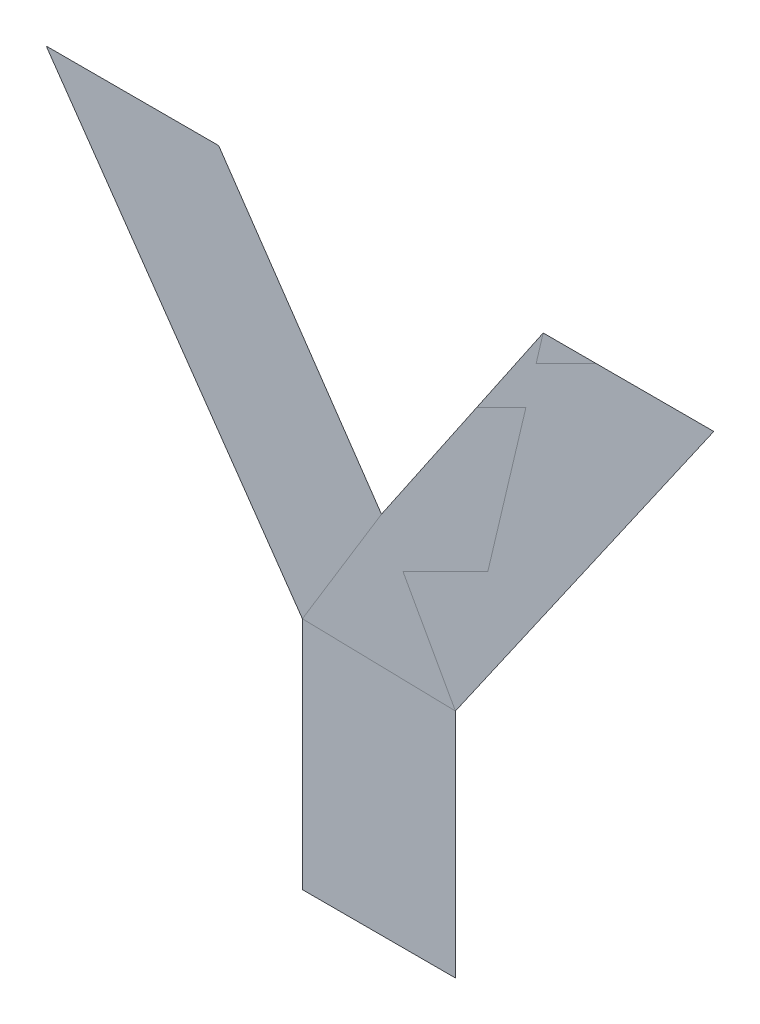
ISO-10303-21;
HEADER;
FILE_DESCRIPTION(('STEP AP214'),'2;1');
FILE_NAME('part.step','',(''),(''),'','','');
FILE_SCHEMA(('AUTOMOTIVE_DESIGN { 1 0 10303 214 1 1 1 1 }'));
ENDSEC;
DATA;
#1=APPLICATION_CONTEXT('core data for automotive mechanical design processes');
#2=APPLICATION_PROTOCOL_DEFINITION('international standard','automotive_design',2000,#1);
#3=PRODUCT_CONTEXT('',#1,'mechanical');
#4=PRODUCT('Part','Part','',(#3));
#5=PRODUCT_RELATED_PRODUCT_CATEGORY('part','',(#4));
#6=PRODUCT_DEFINITION_FORMATION('','',#4);
#7=PRODUCT_DEFINITION_CONTEXT('part definition',#1,'design');
#8=PRODUCT_DEFINITION('design','',#6,#7);
#9=PRODUCT_DEFINITION_SHAPE('','',#8);
#10=(LENGTH_UNIT() NAMED_UNIT(*) SI_UNIT(.MILLI.,.METRE.));
#11=(NAMED_UNIT(*) PLANE_ANGLE_UNIT() SI_UNIT($,.RADIAN.));
#12=(NAMED_UNIT(*) SI_UNIT($,.STERADIAN.) SOLID_ANGLE_UNIT());
#13=UNCERTAINTY_MEASURE_WITH_UNIT(LENGTH_MEASURE(1.E-05),#10,'distance_accuracy_value','');
#14=(GEOMETRIC_REPRESENTATION_CONTEXT(3) GLOBAL_UNCERTAINTY_ASSIGNED_CONTEXT((#13)) GLOBAL_UNIT_ASSIGNED_CONTEXT((#10,
#11,#12)) REPRESENTATION_CONTEXT('',''));
#15=CARTESIAN_POINT('',(0.,0.,0.));
#16=DIRECTION('',(0.,0.,1.));
#17=DIRECTION('',(1.,0.,0.));
#18=AXIS2_PLACEMENT_3D('',#15,#16,#17);
#19=CARTESIAN_POINT('',(0.01323377255932,0.899692190159,0.00015));
#20=DIRECTION('',(0.,0.,1.));
#21=DIRECTION('',(1.,0.,0.));
#22=AXIS2_PLACEMENT_3D('',#19,#20,#21);
#23=PLANE('',#22);
#24=CARTESIAN_POINT('',(0.01329810758435,0.915587292989,0.00015));
#25=DIRECTION('',(-0.564857791545719,0.825188266597443,0.));
#26=VECTOR('',#25,1.);
#27=LINE('',#24,#26);
#28=CARTESIAN_POINT('',(0.01329810758435,0.915587292989,7.5E-05));
#29=VERTEX_POINT('',#28);
#30=CARTESIAN_POINT('',(0.006200809951,0.92595557828,7.5E-05));
#31=VERTEX_POINT('',#30);
#32=EDGE_CURVE('E149',#29,#31,#27,.T.);
#33=ORIENTED_EDGE('',*,*,#32,.T.);
#34=CARTESIAN_POINT('',(0.006200809951,0.92595557828,0.00015));
#35=DIRECTION('',(-1.,0.,0.));
#36=VECTOR('',#35,1.);
#37=LINE('',#34,#36);
#38=CARTESIAN_POINT('',(-0.001316364499,0.92595557828,7.5E-05));
#39=VERTEX_POINT('',#38);
#40=EDGE_CURVE('E28',#31,#39,#37,.T.);
#41=ORIENTED_EDGE('',*,*,#40,.T.);
#42=CARTESIAN_POINT('',(-0.001316364499,0.92595557828,0.00015));
#43=DIRECTION('',(0.571460408227035,-0.820629637430303,0.));
#44=VECTOR('',#43,1.);
#45=LINE('',#42,#44);
#46=CARTESIAN_POINT('',(0.009851043951,0.909918935644,7.5E-05));
#47=VERTEX_POINT('',#46);
#48=EDGE_CURVE('E11',#39,#47,#45,.T.);
#49=ORIENTED_EDGE('',*,*,#48,.T.);
#50=CARTESIAN_POINT('',(0.009851043951,0.909918935644,0.00015));
#51=DIRECTION('',(0.,-1.,0.));
#52=VECTOR('',#51,1.);
#53=LINE('',#50,#52);
#54=CARTESIAN_POINT('',(0.009851043951,0.899692190159,7.5E-05));
#55=VERTEX_POINT('',#54);
#56=EDGE_CURVE('E59',#47,#55,#53,.T.);
#57=ORIENTED_EDGE('',*,*,#56,.T.);
#58=CARTESIAN_POINT('',(0.009851043951,0.899692190159,0.00015));
#59=DIRECTION('',(1.,0.,0.));
#60=VECTOR('',#59,1.);
#61=LINE('',#58,#60);
#62=CARTESIAN_POINT('',(0.01652168931765,0.899692190159,7.5E-05));
#63=VERTEX_POINT('',#62);
#64=EDGE_CURVE('E56',#55,#63,#61,.T.);
#65=ORIENTED_EDGE('',*,*,#64,.T.);
#66=CARTESIAN_POINT('',(0.01652168931765,0.899692190159,0.00015));
#67=DIRECTION('',(0.,1.,0.));
#68=VECTOR('',#67,1.);
#69=LINE('',#66,#68);
#70=CARTESIAN_POINT('',(0.01652168931765,0.909769946652,7.5E-05));
#71=VERTEX_POINT('',#70);
#72=EDGE_CURVE('E143',#63,#71,#69,.T.);
#73=ORIENTED_EDGE('',*,*,#72,.T.);
#74=CARTESIAN_POINT('',(0.01652168931765,0.909769946652,0.00015));
#75=DIRECTION('',(0.571155066162466,0.82084218361202,0.));
#76=VECTOR('',#75,1.);
#77=LINE('',#74,#76);
#78=CARTESIAN_POINT('',(0.02778390961765,0.92595557828,7.5E-05));
#79=VERTEX_POINT('',#78);
#80=EDGE_CURVE('E144',#71,#79,#77,.T.);
#81=ORIENTED_EDGE('',*,*,#80,.T.);
#82=CARTESIAN_POINT('',(0.02778390961765,0.92595557828,0.00015));
#83=DIRECTION('',(-1.,0.,0.));
#84=VECTOR('',#83,1.);
#85=LINE('',#82,#84);
#86=CARTESIAN_POINT('',(0.020348000351,0.92595557828,7.5E-05));
#87=VERTEX_POINT('',#86);
#88=EDGE_CURVE('E145',#79,#87,#85,.T.);
#89=ORIENTED_EDGE('',*,*,#88,.T.);
#90=CARTESIAN_POINT('',(0.020348000351,0.92595557828,0.00015));
#91=DIRECTION('',(-0.562280503031701,-0.826946573794473,0.));
#92=VECTOR('',#91,1.);
#93=LINE('',#90,#92);
#94=EDGE_CURVE('E147',#87,#29,#93,.T.);
#95=ORIENTED_EDGE('',*,*,#94,.T.);
#96=EDGE_LOOP('',(#33,#41,#49,#57,#65,#73,#81,#89,#95));
#97=FACE_BOUND('',#96,.T.);
#98=ADVANCED_FACE('F17',(#97),#23,.T.);
#99=CARTESIAN_POINT('',(0.01323377255932,0.899692190159,0.));
#100=DIRECTION('',(0.,0.,1.));
#101=DIRECTION('',(1.,0.,0.));
#102=AXIS2_PLACEMENT_3D('',#99,#100,#101);
#103=PLANE('',#102);
#104=ORIENTED_EDGE('',*,*,#40,.F.);
#105=ORIENTED_EDGE('',*,*,#32,.F.);
#106=ORIENTED_EDGE('',*,*,#94,.F.);
#107=ORIENTED_EDGE('',*,*,#88,.F.);
#108=ORIENTED_EDGE('',*,*,#80,.F.);
#109=ORIENTED_EDGE('',*,*,#72,.F.);
#110=ORIENTED_EDGE('',*,*,#64,.F.);
#111=ORIENTED_EDGE('',*,*,#56,.F.);
#112=ORIENTED_EDGE('',*,*,#48,.F.);
#113=EDGE_LOOP('',(#104,#105,#106,#107,#108,#109,#110,#111,#112));
#114=FACE_BOUND('',#113,.T.);
#115=ADVANCED_FACE('F61',(#114),#103,.F.);
#116=CLOSED_SHELL('',(#98,#115));
#117=MANIFOLD_SOLID_BREP('B1',#116);
#118=ADVANCED_BREP_SHAPE_REPRESENTATION('',(#18,#117),#14);
#119=SHAPE_DEFINITION_REPRESENTATION(#9,#118);
ENDSEC;
END-ISO-10303-21;
